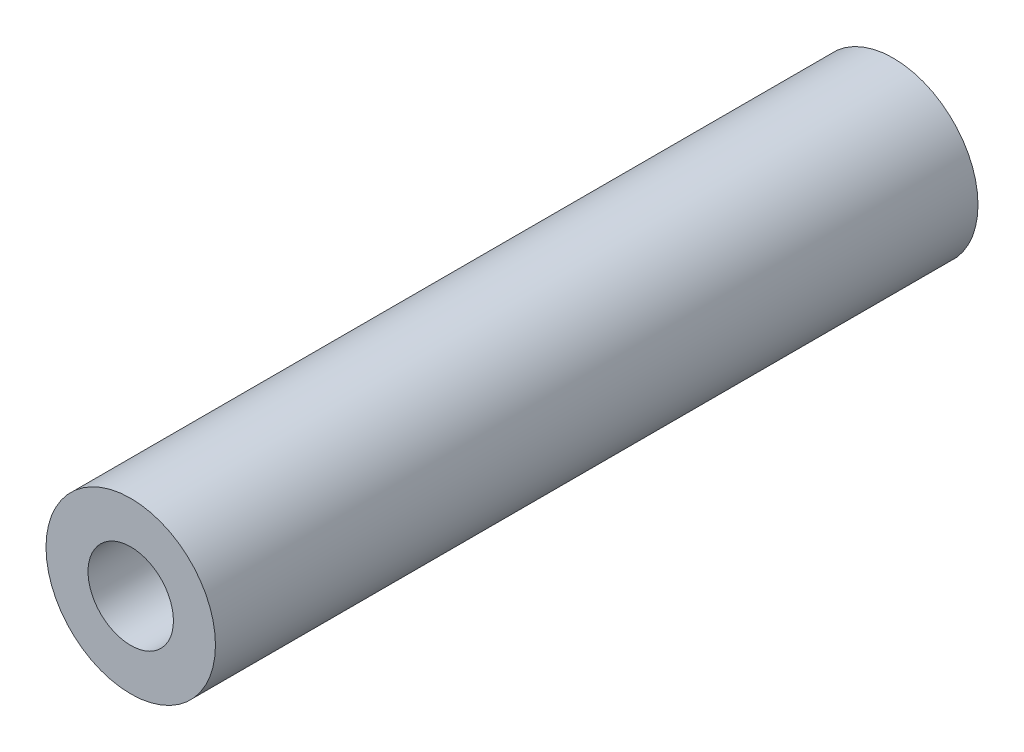
ISO-10303-21;
HEADER;
FILE_DESCRIPTION(('STEP AP214'),'2;1');
FILE_NAME('part.step','',(''),(''),'','','');
FILE_SCHEMA(('AUTOMOTIVE_DESIGN { 1 0 10303 214 1 1 1 1 }'));
ENDSEC;
DATA;
#1=APPLICATION_CONTEXT('core data for automotive mechanical design processes');
#2=APPLICATION_PROTOCOL_DEFINITION('international standard','automotive_design',2000,#1);
#3=PRODUCT_CONTEXT('',#1,'mechanical');
#4=PRODUCT('Part','Part','',(#3));
#5=PRODUCT_RELATED_PRODUCT_CATEGORY('part','',(#4));
#6=PRODUCT_DEFINITION_FORMATION('','',#4);
#7=PRODUCT_DEFINITION_CONTEXT('part definition',#1,'design');
#8=PRODUCT_DEFINITION('design','',#6,#7);
#9=PRODUCT_DEFINITION_SHAPE('','',#8);
#10=(LENGTH_UNIT() NAMED_UNIT(*) SI_UNIT(.MILLI.,.METRE.));
#11=(NAMED_UNIT(*) PLANE_ANGLE_UNIT() SI_UNIT($,.RADIAN.));
#12=(NAMED_UNIT(*) SI_UNIT($,.STERADIAN.) SOLID_ANGLE_UNIT());
#13=UNCERTAINTY_MEASURE_WITH_UNIT(LENGTH_MEASURE(1.E-05),#10,'distance_accuracy_value','');
#14=(GEOMETRIC_REPRESENTATION_CONTEXT(3) GLOBAL_UNCERTAINTY_ASSIGNED_CONTEXT((#13)) GLOBAL_UNIT_ASSIGNED_CONTEXT((#10,
#11,#12)) REPRESENTATION_CONTEXT('',''));
#15=CARTESIAN_POINT('',(0.,0.,0.));
#16=DIRECTION('',(0.,0.,1.));
#17=DIRECTION('',(1.,0.,0.));
#18=AXIS2_PLACEMENT_3D('',#15,#16,#17);
#19=CARTESIAN_POINT('',(0.,0.,28.575));
#20=DIRECTION('',(0.,0.,1.));
#21=DIRECTION('',(1.,0.,0.));
#22=AXIS2_PLACEMENT_3D('',#19,#20,#21);
#23=PLANE('',#22);
#24=CARTESIAN_POINT('',(0.,0.,28.575));
#25=DIRECTION('',(0.,0.,1.));
#26=DIRECTION('',(1.,0.,0.));
#27=AXIS2_PLACEMENT_3D('',#24,#25,#26);
#28=CIRCLE('',#27,6.35);
#29=CARTESIAN_POINT('',(6.35,0.,28.575));
#30=VERTEX_POINT('',#29);
#31=EDGE_CURVE('E10',#30,#30,#28,.T.);
#32=ORIENTED_EDGE('',*,*,#31,.T.);
#33=EDGE_LOOP('',(#32));
#34=FACE_BOUND('',#33,.T.);
#35=CARTESIAN_POINT('',(0.,0.,28.575));
#36=DIRECTION('',(0.,0.,1.));
#37=DIRECTION('',(1.,0.,0.));
#38=AXIS2_PLACEMENT_3D('',#35,#36,#37);
#39=CIRCLE('',#38,3.2004);
#40=CARTESIAN_POINT('',(3.2004,0.,28.575));
#41=VERTEX_POINT('',#40);
#42=EDGE_CURVE('E44',#41,#41,#39,.T.);
#43=ORIENTED_EDGE('',*,*,#42,.F.);
#44=EDGE_LOOP('',(#43));
#45=FACE_BOUND('',#44,.T.);
#46=ADVANCED_FACE('F33',(#34,#45),#23,.T.);
#47=CARTESIAN_POINT('',(0.,0.,-28.575));
#48=DIRECTION('',(0.,0.,1.));
#49=DIRECTION('',(1.,0.,0.));
#50=AXIS2_PLACEMENT_3D('',#47,#48,#49);
#51=PLANE('',#50);
#52=CARTESIAN_POINT('',(0.,0.,-28.575));
#53=DIRECTION('',(0.,0.,1.));
#54=DIRECTION('',(1.,0.,0.));
#55=AXIS2_PLACEMENT_3D('',#52,#53,#54);
#56=CIRCLE('',#55,6.35);
#57=CARTESIAN_POINT('',(6.35,0.,-28.575));
#58=VERTEX_POINT('',#57);
#59=EDGE_CURVE('E37',#58,#58,#56,.T.);
#60=ORIENTED_EDGE('',*,*,#59,.F.);
#61=EDGE_LOOP('',(#60));
#62=FACE_BOUND('',#61,.T.);
#63=CARTESIAN_POINT('',(0.,0.,-28.575));
#64=DIRECTION('',(0.,0.,1.));
#65=DIRECTION('',(1.,0.,0.));
#66=AXIS2_PLACEMENT_3D('',#63,#64,#65);
#67=CIRCLE('',#66,3.2004);
#68=CARTESIAN_POINT('',(3.2004,0.,-28.575));
#69=VERTEX_POINT('',#68);
#70=EDGE_CURVE('E46',#69,#69,#67,.T.);
#71=ORIENTED_EDGE('',*,*,#70,.T.);
#72=EDGE_LOOP('',(#71));
#73=FACE_BOUND('',#72,.T.);
#74=ADVANCED_FACE('F56',(#62,#73),#51,.F.);
#75=CARTESIAN_POINT('',(0.,0.,28.575));
#76=DIRECTION('',(0.,0.,-1.));
#77=DIRECTION('',(-1.,0.,0.));
#78=AXIS2_PLACEMENT_3D('',#75,#76,#77);
#79=CYLINDRICAL_SURFACE('',#78,6.35);
#80=ORIENTED_EDGE('',*,*,#31,.F.);
#81=EDGE_LOOP('',(#80));
#82=FACE_BOUND('',#81,.T.);
#83=ORIENTED_EDGE('',*,*,#59,.T.);
#84=EDGE_LOOP('',(#83));
#85=FACE_BOUND('',#84,.T.);
#86=ADVANCED_FACE('F35',(#82,#85),#79,.T.);
#87=CARTESIAN_POINT('',(0.,0.,28.575));
#88=DIRECTION('',(0.,0.,-1.));
#89=DIRECTION('',(-1.,0.,0.));
#90=AXIS2_PLACEMENT_3D('',#87,#88,#89);
#91=CYLINDRICAL_SURFACE('',#90,3.2004);
#92=ORIENTED_EDGE('',*,*,#42,.T.);
#93=EDGE_LOOP('',(#92));
#94=FACE_BOUND('',#93,.T.);
#95=ORIENTED_EDGE('',*,*,#70,.F.);
#96=EDGE_LOOP('',(#95));
#97=FACE_BOUND('',#96,.T.);
#98=ADVANCED_FACE('F52',(#94,#97),#91,.F.);
#99=CLOSED_SHELL('',(#46,#74,#86,#98));
#100=MANIFOLD_SOLID_BREP('B2',#99);
#101=ADVANCED_BREP_SHAPE_REPRESENTATION('',(#18,#100),#14);
#102=SHAPE_DEFINITION_REPRESENTATION(#9,#101);
ENDSEC;
END-ISO-10303-21;
